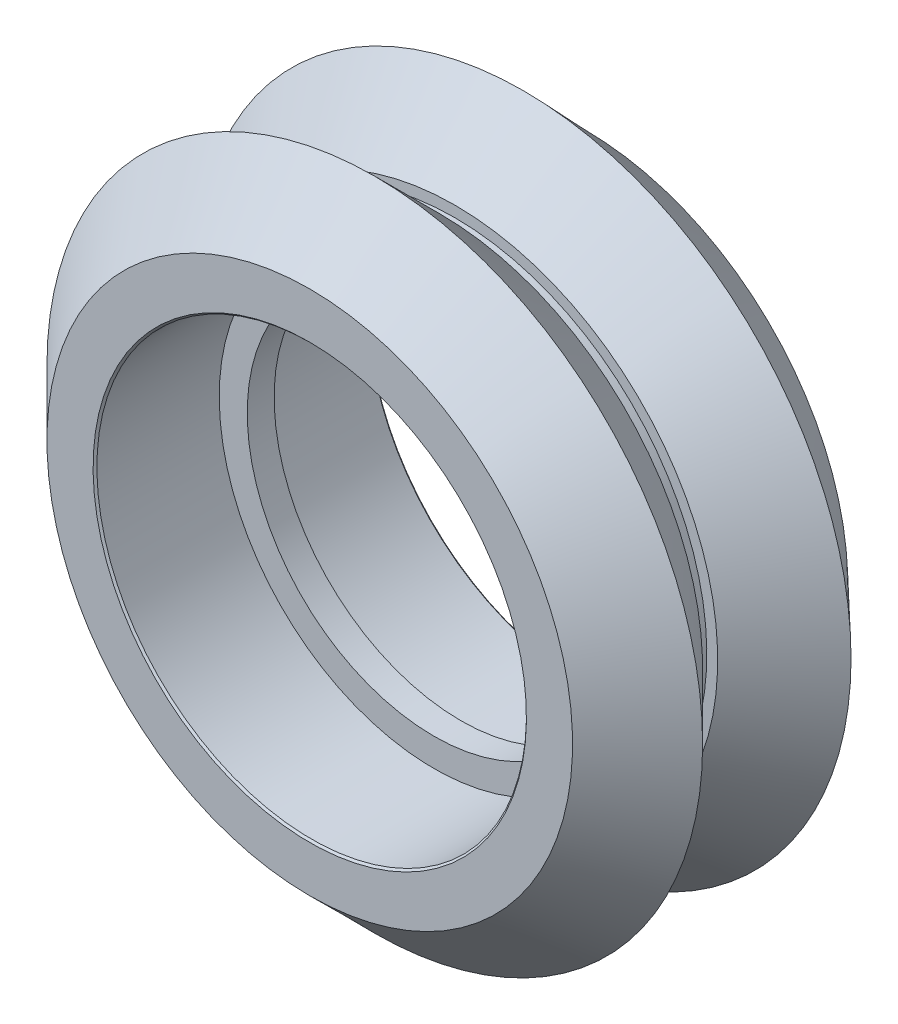
ISO-10303-21;
HEADER;
FILE_DESCRIPTION(('STEP AP214'),'2;1');
FILE_NAME('part.step','',(''),(''),'','','');
FILE_SCHEMA(('AUTOMOTIVE_DESIGN { 1 0 10303 214 1 1 1 1 }'));
ENDSEC;
DATA;
#1=APPLICATION_CONTEXT('core data for automotive mechanical design processes');
#2=APPLICATION_PROTOCOL_DEFINITION('international standard','automotive_design',2000,#1);
#3=PRODUCT_CONTEXT('',#1,'mechanical');
#4=PRODUCT('Part','Part','',(#3));
#5=PRODUCT_RELATED_PRODUCT_CATEGORY('part','',(#4));
#6=PRODUCT_DEFINITION_FORMATION('','',#4);
#7=PRODUCT_DEFINITION_CONTEXT('part definition',#1,'design');
#8=PRODUCT_DEFINITION('design','',#6,#7);
#9=PRODUCT_DEFINITION_SHAPE('','',#8);
#10=(LENGTH_UNIT() NAMED_UNIT(*) SI_UNIT(.MILLI.,.METRE.));
#11=(NAMED_UNIT(*) PLANE_ANGLE_UNIT() SI_UNIT($,.RADIAN.));
#12=(NAMED_UNIT(*) SI_UNIT($,.STERADIAN.) SOLID_ANGLE_UNIT());
#13=UNCERTAINTY_MEASURE_WITH_UNIT(LENGTH_MEASURE(1.E-05),#10,'distance_accuracy_value','');
#14=(GEOMETRIC_REPRESENTATION_CONTEXT(3) GLOBAL_UNCERTAINTY_ASSIGNED_CONTEXT((#13)) GLOBAL_UNIT_ASSIGNED_CONTEXT((#10,
#11,#12)) REPRESENTATION_CONTEXT('',''));
#15=CARTESIAN_POINT('',(0.,0.,0.));
#16=DIRECTION('',(0.,0.,1.));
#17=DIRECTION('',(1.,0.,0.));
#18=AXIS2_PLACEMENT_3D('',#15,#16,#17);
#19=CARTESIAN_POINT('',(0.,7.987,0.504999999999999));
#20=DIRECTION('',(0.,0.,-1.));
#21=DIRECTION('',(-1.,0.,0.));
#22=AXIS2_PLACEMENT_3D('',#19,#20,#21);
#23=PLANE('',#22);
#24=CARTESIAN_POINT('',(0.,0.,0.504999999999999));
#25=DIRECTION('',(0.,0.,1.));
#26=DIRECTION('',(0.,1.,0.));
#27=AXIS2_PLACEMENT_3D('',#24,#25,#26);
#28=CIRCLE('',#27,7.987);
#29=CARTESIAN_POINT('',(0.,7.987,0.504999999999999));
#30=VERTEX_POINT('',#29);
#31=EDGE_CURVE('E105',#30,#30,#28,.T.);
#32=ORIENTED_EDGE('',*,*,#31,.T.);
#33=EDGE_LOOP('',(#32));
#34=FACE_BOUND('',#33,.T.);
#35=CARTESIAN_POINT('',(0.,0.,0.504999999999999));
#36=DIRECTION('',(0.,0.,1.));
#37=DIRECTION('',(0.,1.,0.));
#38=AXIS2_PLACEMENT_3D('',#35,#36,#37);
#39=CIRCLE('',#38,6.945);
#40=CARTESIAN_POINT('',(0.,6.945,0.504999999999999));
#41=VERTEX_POINT('',#40);
#42=EDGE_CURVE('E107',#41,#41,#39,.T.);
#43=ORIENTED_EDGE('',*,*,#42,.F.);
#44=EDGE_LOOP('',(#43));
#45=FACE_BOUND('',#44,.T.);
#46=ADVANCED_FACE('F35',(#34,#45),#23,.F.);
#47=CARTESIAN_POINT('',(0.,0.,0.));
#48=DIRECTION('',(0.,0.,1.));
#49=DIRECTION('',(1.,0.,0.));
#50=AXIS2_PLACEMENT_3D('',#47,#48,#49);
#51=CYLINDRICAL_SURFACE('',#50,6.945);
#52=DIRECTION('',(0.,0.,-1.));
#53=VECTOR('',#52,1.);
#54=CARTESIAN_POINT('',(0.,6.945,0.504999999999999));
#55=LINE('',#54,#53);
#56=CARTESIAN_POINT('',(0.,6.945,-0.495000000000001));
#57=VERTEX_POINT('',#56);
#58=EDGE_CURVE('E109',#41,#57,#55,.T.);
#59=ORIENTED_EDGE('',*,*,#58,.T.);
#60=CARTESIAN_POINT('',(0.,0.,-0.495000000000001));
#61=DIRECTION('',(0.,0.,1.));
#62=DIRECTION('',(0.,1.,0.));
#63=AXIS2_PLACEMENT_3D('',#60,#61,#62);
#64=CIRCLE('',#63,6.945);
#65=EDGE_CURVE('E115',#57,#57,#64,.T.);
#66=ORIENTED_EDGE('',*,*,#65,.F.);
#67=ORIENTED_EDGE('',*,*,#58,.F.);
#68=ORIENTED_EDGE('',*,*,#42,.T.);
#69=EDGE_LOOP('',(#59,#66,#67,#68));
#70=FACE_BOUND('',#69,.T.);
#71=ADVANCED_FACE('F225',(#70),#51,.F.);
#72=CARTESIAN_POINT('',(0.,6.945,-0.495000000000001));
#73=DIRECTION('',(0.,0.,1.));
#74=DIRECTION('',(1.,0.,0.));
#75=AXIS2_PLACEMENT_3D('',#72,#73,#74);
#76=PLANE('',#75);
#77=ORIENTED_EDGE('',*,*,#65,.T.);
#78=EDGE_LOOP('',(#77));
#79=FACE_BOUND('',#78,.T.);
#80=CARTESIAN_POINT('',(0.,0.,-0.495000000000001));
#81=DIRECTION('',(0.,0.,1.));
#82=DIRECTION('',(0.,1.,0.));
#83=AXIS2_PLACEMENT_3D('',#80,#81,#82);
#84=CIRCLE('',#83,7.987);
#85=CARTESIAN_POINT('',(0.,7.987,-0.495000000000001));
#86=VERTEX_POINT('',#85);
#87=EDGE_CURVE('E119',#86,#86,#84,.T.);
#88=ORIENTED_EDGE('',*,*,#87,.F.);
#89=EDGE_LOOP('',(#88));
#90=FACE_BOUND('',#89,.T.);
#91=ADVANCED_FACE('F222',(#79,#90),#76,.F.);
#92=CARTESIAN_POINT('',(0.,0.,0.));
#93=DIRECTION('',(0.,0.,1.));
#94=DIRECTION('',(1.,0.,0.));
#95=AXIS2_PLACEMENT_3D('',#92,#93,#94);
#96=CYLINDRICAL_SURFACE('',#95,7.987);
#97=DIRECTION('',(0.,0.,-1.));
#98=VECTOR('',#97,1.);
#99=CARTESIAN_POINT('',(0.,7.987,-0.495000000000001));
#100=LINE('',#99,#98);
#101=CARTESIAN_POINT('',(0.,7.987,-5.04428932188135));
#102=VERTEX_POINT('',#101);
#103=EDGE_CURVE('E121',#86,#102,#100,.T.);
#104=ORIENTED_EDGE('',*,*,#103,.T.);
#105=CARTESIAN_POINT('',(0.,0.,-5.04428932188135));
#106=DIRECTION('',(0.,0.,1.));
#107=DIRECTION('',(0.,1.,0.));
#108=AXIS2_PLACEMENT_3D('',#105,#106,#107);
#109=CIRCLE('',#108,7.987);
#110=EDGE_CURVE('E124',#102,#102,#109,.T.);
#111=ORIENTED_EDGE('',*,*,#110,.F.);
#112=ORIENTED_EDGE('',*,*,#103,.F.);
#113=ORIENTED_EDGE('',*,*,#87,.T.);
#114=EDGE_LOOP('',(#104,#111,#112,#113));
#115=FACE_BOUND('',#114,.T.);
#116=ADVANCED_FACE('F218',(#115),#96,.F.);
#117=CARTESIAN_POINT('',(0.,0.,-5.04428932188135));
#118=DIRECTION('',(0.,0.,-1.));
#119=DIRECTION('',(-1.,0.,0.));
#120=AXIS2_PLACEMENT_3D('',#117,#118,#119);
#121=CONICAL_SURFACE('',#120,7.987,0.785398163397436);
#122=DIRECTION('',(0.,0.707106781186539,-0.707106781186556));
#123=VECTOR('',#122,1.);
#124=CARTESIAN_POINT('',(0.,7.987,-5.04428932188135));
#125=LINE('',#124,#123);
#126=CARTESIAN_POINT('',(0.,8.05771067811865,-5.115));
#127=VERTEX_POINT('',#126);
#128=EDGE_CURVE('E126',#102,#127,#125,.T.);
#129=ORIENTED_EDGE('',*,*,#128,.T.);
#130=CARTESIAN_POINT('',(0.,0.,-5.115));
#131=DIRECTION('',(0.,0.,1.));
#132=DIRECTION('',(0.,1.,0.));
#133=AXIS2_PLACEMENT_3D('',#130,#131,#132);
#134=CIRCLE('',#133,8.05771067811865);
#135=EDGE_CURVE('E129',#127,#127,#134,.T.);
#136=ORIENTED_EDGE('',*,*,#135,.F.);
#137=ORIENTED_EDGE('',*,*,#128,.F.);
#138=ORIENTED_EDGE('',*,*,#110,.T.);
#139=EDGE_LOOP('',(#129,#136,#137,#138));
#140=FACE_BOUND('',#139,.T.);
#141=ADVANCED_FACE('F214',(#140),#121,.F.);
#142=CARTESIAN_POINT('',(0.,8.05771067811865,-5.115));
#143=DIRECTION('',(0.,0.,1.));
#144=DIRECTION('',(1.,0.,0.));
#145=AXIS2_PLACEMENT_3D('',#142,#143,#144);
#146=PLANE('',#145);
#147=ORIENTED_EDGE('',*,*,#135,.T.);
#148=EDGE_LOOP('',(#147));
#149=FACE_BOUND('',#148,.T.);
#150=CARTESIAN_POINT('',(0.,0.,-5.115));
#151=DIRECTION('',(0.,0.,1.));
#152=DIRECTION('',(0.,1.,0.));
#153=AXIS2_PLACEMENT_3D('',#150,#151,#152);
#154=CIRCLE('',#153,9.77);
#155=CARTESIAN_POINT('',(0.,9.77,-5.115));
#156=VERTEX_POINT('',#155);
#157=EDGE_CURVE('E134',#156,#156,#154,.T.);
#158=ORIENTED_EDGE('',*,*,#157,.F.);
#159=EDGE_LOOP('',(#158));
#160=FACE_BOUND('',#159,.T.);
#161=ADVANCED_FACE('F210',(#149,#160),#146,.F.);
#162=CARTESIAN_POINT('',(0.,0.,-5.115));
#163=DIRECTION('',(0.,0.,1.));
#164=DIRECTION('',(1.,0.,0.));
#165=AXIS2_PLACEMENT_3D('',#162,#163,#164);
#166=CONICAL_SURFACE('',#165,9.77,0.8107092125403);
#167=DIRECTION('',(0.,0.724775993112463,0.688984586045177));
#168=VECTOR('',#167,1.);
#169=CARTESIAN_POINT('',(0.,9.77,-5.115));
#170=LINE('',#169,#168);
#171=CARTESIAN_POINT('',(0.,12.1868999199359,-2.81745316253004));
#172=VERTEX_POINT('',#171);
#173=EDGE_CURVE('E136',#156,#172,#170,.T.);
#174=ORIENTED_EDGE('',*,*,#173,.T.);
#175=CARTESIAN_POINT('',(0.,0.,-2.81745316253004));
#176=DIRECTION('',(0.,0.,1.));
#177=DIRECTION('',(0.,1.,0.));
#178=AXIS2_PLACEMENT_3D('',#175,#176,#177);
#179=CIRCLE('',#178,12.1868999199359);
#180=EDGE_CURVE('E139',#172,#172,#179,.T.);
#181=ORIENTED_EDGE('',*,*,#180,.F.);
#182=ORIENTED_EDGE('',*,*,#173,.F.);
#183=ORIENTED_EDGE('',*,*,#157,.T.);
#184=EDGE_LOOP('',(#174,#181,#182,#183));
#185=FACE_BOUND('',#184,.T.);
#186=ADVANCED_FACE('F206',(#185),#166,.T.);
#187=CARTESIAN_POINT('',(0.,0.,-2.81745316253004));
#188=DIRECTION('',(0.,0.,-1.));
#189=DIRECTION('',(-1.,0.,0.));
#190=AXIS2_PLACEMENT_3D('',#187,#188,#189);
#191=CONICAL_SURFACE('',#190,12.1868999199359,0.760087114254597);
#192=DIRECTION('',(0.,-0.688984586045177,0.724775993112463));
#193=VECTOR('',#192,1.);
#194=CARTESIAN_POINT('',(0.,12.1868999199359,-2.81745316253004));
#195=LINE('',#194,#193);
#196=CARTESIAN_POINT('',(0.,9.77,-0.275000000000001));
#197=VERTEX_POINT('',#196);
#198=EDGE_CURVE('E141',#172,#197,#195,.T.);
#199=ORIENTED_EDGE('',*,*,#198,.T.);
#200=CARTESIAN_POINT('',(0.,0.,-0.275000000000001));
#201=DIRECTION('',(0.,0.,1.));
#202=DIRECTION('',(0.,1.,0.));
#203=AXIS2_PLACEMENT_3D('',#200,#201,#202);
#204=CIRCLE('',#203,9.77);
#205=EDGE_CURVE('E144',#197,#197,#204,.T.);
#206=ORIENTED_EDGE('',*,*,#205,.F.);
#207=ORIENTED_EDGE('',*,*,#198,.F.);
#208=ORIENTED_EDGE('',*,*,#180,.T.);
#209=EDGE_LOOP('',(#199,#206,#207,#208));
#210=FACE_BOUND('',#209,.T.);
#211=ADVANCED_FACE('F202',(#210),#191,.T.);
#212=CARTESIAN_POINT('',(0.,0.,-0.275000000000001));
#213=DIRECTION('',(0.,0.,-1.));
#214=DIRECTION('',(-1.,0.,0.));
#215=AXIS2_PLACEMENT_3D('',#212,#213,#214);
#216=CONICAL_SURFACE('',#215,9.77,1.54548527765205);
#217=DIRECTION('',(0.,-0.999679692496588,0.0253083466454847));
#218=VECTOR('',#217,1.);
#219=CARTESIAN_POINT('',(0.,9.77,-0.275000000000001));
#220=LINE('',#219,#218);
#221=CARTESIAN_POINT('',(0.,9.375,-0.265));
#222=VERTEX_POINT('',#221);
#223=EDGE_CURVE('E146',#197,#222,#220,.T.);
#224=ORIENTED_EDGE('',*,*,#223,.T.);
#225=CARTESIAN_POINT('',(0.,0.,-0.265));
#226=DIRECTION('',(0.,0.,1.));
#227=DIRECTION('',(0.,1.,0.));
#228=AXIS2_PLACEMENT_3D('',#225,#226,#227);
#229=CIRCLE('',#228,9.375);
#230=EDGE_CURVE('E149',#222,#222,#229,.T.);
#231=ORIENTED_EDGE('',*,*,#230,.F.);
#232=ORIENTED_EDGE('',*,*,#223,.F.);
#233=ORIENTED_EDGE('',*,*,#205,.T.);
#234=EDGE_LOOP('',(#224,#231,#232,#233));
#235=FACE_BOUND('',#234,.T.);
#236=ADVANCED_FACE('F198',(#235),#216,.T.);
#237=CARTESIAN_POINT('',(0.,0.,0.));
#238=DIRECTION('',(0.,0.,1.));
#239=DIRECTION('',(1.,0.,0.));
#240=AXIS2_PLACEMENT_3D('',#237,#238,#239);
#241=CYLINDRICAL_SURFACE('',#240,9.375);
#242=DIRECTION('',(0.,0.,1.));
#243=VECTOR('',#242,1.);
#244=CARTESIAN_POINT('',(0.,9.375,-0.265));
#245=LINE('',#244,#243);
#246=CARTESIAN_POINT('',(0.,9.375,0.285));
#247=VERTEX_POINT('',#246);
#248=EDGE_CURVE('E151',#222,#247,#245,.T.);
#249=ORIENTED_EDGE('',*,*,#248,.T.);
#250=CARTESIAN_POINT('',(0.,0.,0.285));
#251=DIRECTION('',(0.,0.,1.));
#252=DIRECTION('',(0.,1.,0.));
#253=AXIS2_PLACEMENT_3D('',#250,#251,#252);
#254=CIRCLE('',#253,9.375);
#255=EDGE_CURVE('E154',#247,#247,#254,.T.);
#256=ORIENTED_EDGE('',*,*,#255,.F.);
#257=ORIENTED_EDGE('',*,*,#248,.F.);
#258=ORIENTED_EDGE('',*,*,#230,.T.);
#259=EDGE_LOOP('',(#249,#256,#257,#258));
#260=FACE_BOUND('',#259,.T.);
#261=ADVANCED_FACE('F194',(#260),#241,.T.);
#262=CARTESIAN_POINT('',(0.,9.375,0.285));
#263=DIRECTION('',(0.,0.,1.));
#264=DIRECTION('',(1.,0.,0.));
#265=AXIS2_PLACEMENT_3D('',#262,#263,#264);
#266=PLANE('',#265);
#267=ORIENTED_EDGE('',*,*,#255,.T.);
#268=EDGE_LOOP('',(#267));
#269=FACE_BOUND('',#268,.T.);
#270=CARTESIAN_POINT('',(0.,0.,0.285));
#271=DIRECTION('',(0.,0.,1.));
#272=DIRECTION('',(0.,1.,0.));
#273=AXIS2_PLACEMENT_3D('',#270,#271,#272);
#274=CIRCLE('',#273,9.77);
#275=CARTESIAN_POINT('',(0.,9.77,0.285));
#276=VERTEX_POINT('',#275);
#277=EDGE_CURVE('E159',#276,#276,#274,.T.);
#278=ORIENTED_EDGE('',*,*,#277,.F.);
#279=EDGE_LOOP('',(#278));
#280=FACE_BOUND('',#279,.T.);
#281=ADVANCED_FACE('F190',(#269,#280),#266,.F.);
#282=CARTESIAN_POINT('',(0.,0.,0.285));
#283=DIRECTION('',(0.,0.,1.));
#284=DIRECTION('',(1.,0.,0.));
#285=AXIS2_PLACEMENT_3D('',#282,#283,#284);
#286=CONICAL_SURFACE('',#285,9.77,0.785398163397446);
#287=DIRECTION('',(0.,0.707106781186546,0.707106781186549));
#288=VECTOR('',#287,1.);
#289=CARTESIAN_POINT('',(0.,9.77,0.285));
#290=LINE('',#289,#288);
#291=CARTESIAN_POINT('',(0.,12.191694808342,2.70669480834201));
#292=VERTEX_POINT('',#291);
#293=EDGE_CURVE('E161',#276,#292,#290,.T.);
#294=ORIENTED_EDGE('',*,*,#293,.T.);
#295=CARTESIAN_POINT('',(0.,0.,2.70669480834201));
#296=DIRECTION('',(0.,0.,1.));
#297=DIRECTION('',(0.,1.,0.));
#298=AXIS2_PLACEMENT_3D('',#295,#296,#297);
#299=CIRCLE('',#298,12.191694808342);
#300=EDGE_CURVE('E164',#292,#292,#299,.T.);
#301=ORIENTED_EDGE('',*,*,#300,.F.);
#302=ORIENTED_EDGE('',*,*,#293,.F.);
#303=ORIENTED_EDGE('',*,*,#277,.T.);
#304=EDGE_LOOP('',(#294,#301,#302,#303));
#305=FACE_BOUND('',#304,.T.);
#306=ADVANCED_FACE('F186',(#305),#286,.T.);
#307=CARTESIAN_POINT('',(0.,0.,2.70669480834201));
#308=DIRECTION('',(0.,0.,-1.));
#309=DIRECTION('',(-1.,0.,0.));
#310=AXIS2_PLACEMENT_3D('',#307,#308,#309);
#311=CONICAL_SURFACE('',#310,12.191694808342,0.785398163397446);
#312=DIRECTION('',(0.,-0.707106781186546,0.707106781186549));
#313=VECTOR('',#312,1.);
#314=CARTESIAN_POINT('',(0.,12.191694808342,2.70669480834201));
#315=LINE('',#314,#313);
#316=CARTESIAN_POINT('',(0.,9.77338961668402,5.125));
#317=VERTEX_POINT('',#316);
#318=EDGE_CURVE('E166',#292,#317,#315,.T.);
#319=ORIENTED_EDGE('',*,*,#318,.T.);
#320=CARTESIAN_POINT('',(0.,0.,5.125));
#321=DIRECTION('',(0.,0.,1.));
#322=DIRECTION('',(0.,1.,0.));
#323=AXIS2_PLACEMENT_3D('',#320,#321,#322);
#324=CIRCLE('',#323,9.77338961668402);
#325=EDGE_CURVE('E169',#317,#317,#324,.T.);
#326=ORIENTED_EDGE('',*,*,#325,.F.);
#327=ORIENTED_EDGE('',*,*,#318,.F.);
#328=ORIENTED_EDGE('',*,*,#300,.T.);
#329=EDGE_LOOP('',(#319,#326,#327,#328));
#330=FACE_BOUND('',#329,.T.);
#331=ADVANCED_FACE('F182',(#330),#311,.T.);
#332=CARTESIAN_POINT('',(0.,9.77338961668402,5.125));
#333=DIRECTION('',(0.,0.,-1.));
#334=DIRECTION('',(-1.,0.,0.));
#335=AXIS2_PLACEMENT_3D('',#332,#333,#334);
#336=PLANE('',#335);
#337=ORIENTED_EDGE('',*,*,#325,.T.);
#338=EDGE_LOOP('',(#337));
#339=FACE_BOUND('',#338,.T.);
#340=CARTESIAN_POINT('',(0.,0.,5.12499999999999));
#341=DIRECTION('',(0.,0.,1.));
#342=DIRECTION('',(0.,1.,0.));
#343=AXIS2_PLACEMENT_3D('',#340,#341,#342);
#344=CIRCLE('',#343,8.05771067811865);
#345=CARTESIAN_POINT('',(0.,8.05771067811865,5.12499999999999));
#346=VERTEX_POINT('',#345);
#347=EDGE_CURVE('E44',#346,#346,#344,.T.);
#348=ORIENTED_EDGE('',*,*,#347,.F.);
#349=EDGE_LOOP('',(#348));
#350=FACE_BOUND('',#349,.T.);
#351=ADVANCED_FACE('F178',(#339,#350),#336,.F.);
#352=CARTESIAN_POINT('',(0.,0.,5.12499999999999));
#353=DIRECTION('',(0.,0.,1.));
#354=DIRECTION('',(1.,0.,0.));
#355=AXIS2_PLACEMENT_3D('',#352,#353,#354);
#356=CONICAL_SURFACE('',#355,8.05771067811865,0.785398163397418);
#357=DIRECTION('',(0.,-0.707106781186526,-0.707106781186569));
#358=VECTOR('',#357,1.);
#359=CARTESIAN_POINT('',(0.,8.05771067811865,5.12499999999999));
#360=LINE('',#359,#358);
#361=CARTESIAN_POINT('',(0.,7.987,5.05428932188133));
#362=VERTEX_POINT('',#361);
#363=EDGE_CURVE('E51',#346,#362,#360,.T.);
#364=ORIENTED_EDGE('',*,*,#363,.T.);
#365=CARTESIAN_POINT('',(0.,0.,5.05428932188133));
#366=DIRECTION('',(0.,0.,1.));
#367=DIRECTION('',(0.,1.,0.));
#368=AXIS2_PLACEMENT_3D('',#365,#366,#367);
#369=CIRCLE('',#368,7.987);
#370=EDGE_CURVE('E11',#362,#362,#369,.T.);
#371=ORIENTED_EDGE('',*,*,#370,.F.);
#372=ORIENTED_EDGE('',*,*,#363,.F.);
#373=ORIENTED_EDGE('',*,*,#347,.T.);
#374=EDGE_LOOP('',(#364,#371,#372,#373));
#375=FACE_BOUND('',#374,.T.);
#376=ADVANCED_FACE('F177',(#375),#356,.F.);
#377=CARTESIAN_POINT('',(0.,0.,0.));
#378=DIRECTION('',(0.,0.,1.));
#379=DIRECTION('',(1.,0.,0.));
#380=AXIS2_PLACEMENT_3D('',#377,#378,#379);
#381=CYLINDRICAL_SURFACE('',#380,7.987);
#382=DIRECTION('',(0.,0.,-1.));
#383=VECTOR('',#382,1.);
#384=CARTESIAN_POINT('',(0.,7.987,5.05428932188133));
#385=LINE('',#384,#383);
#386=EDGE_CURVE('E39',#362,#30,#385,.T.);
#387=ORIENTED_EDGE('',*,*,#386,.T.);
#388=ORIENTED_EDGE('',*,*,#31,.F.);
#389=ORIENTED_EDGE('',*,*,#386,.F.);
#390=ORIENTED_EDGE('',*,*,#370,.T.);
#391=EDGE_LOOP('',(#387,#388,#389,#390));
#392=FACE_BOUND('',#391,.T.);
#393=ADVANCED_FACE('F37',(#392),#381,.F.);
#394=CLOSED_SHELL('',(#46,#71,#91,#116,#141,#161,#186,#211,#236,#261,#281,#306,#331,#351,#376,#393));
#395=MANIFOLD_SOLID_BREP('B2',#394);
#396=ADVANCED_BREP_SHAPE_REPRESENTATION('',(#18,#395),#14);
#397=SHAPE_DEFINITION_REPRESENTATION(#9,#396);
ENDSEC;
END-ISO-10303-21;
